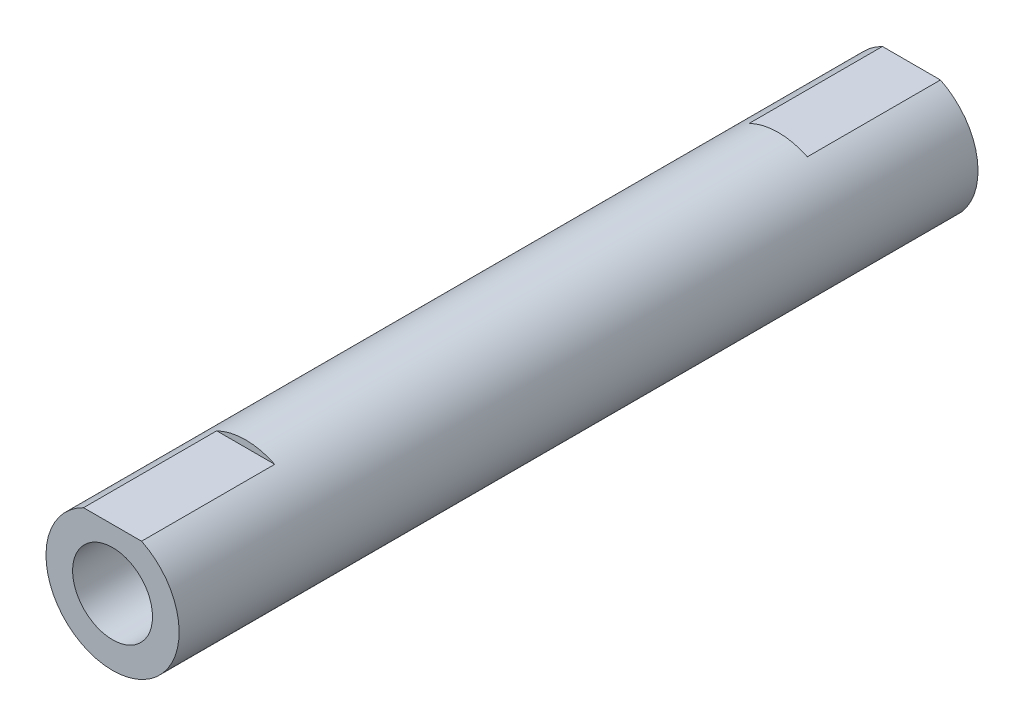
ISO-10303-21;
HEADER;
FILE_DESCRIPTION(('STEP AP214'),'2;1');
FILE_NAME('part.step','',(''),(''),'','','');
FILE_SCHEMA(('AUTOMOTIVE_DESIGN { 1 0 10303 214 1 1 1 1 }'));
ENDSEC;
DATA;
#1=APPLICATION_CONTEXT('core data for automotive mechanical design processes');
#2=APPLICATION_PROTOCOL_DEFINITION('international standard','automotive_design',2000,#1);
#3=PRODUCT_CONTEXT('',#1,'mechanical');
#4=PRODUCT('Part','Part','',(#3));
#5=PRODUCT_RELATED_PRODUCT_CATEGORY('part','',(#4));
#6=PRODUCT_DEFINITION_FORMATION('','',#4);
#7=PRODUCT_DEFINITION_CONTEXT('part definition',#1,'design');
#8=PRODUCT_DEFINITION('design','',#6,#7);
#9=PRODUCT_DEFINITION_SHAPE('','',#8);
#10=(LENGTH_UNIT() NAMED_UNIT(*) SI_UNIT(.MILLI.,.METRE.));
#11=(NAMED_UNIT(*) PLANE_ANGLE_UNIT() SI_UNIT($,.RADIAN.));
#12=(NAMED_UNIT(*) SI_UNIT($,.STERADIAN.) SOLID_ANGLE_UNIT());
#13=UNCERTAINTY_MEASURE_WITH_UNIT(LENGTH_MEASURE(1.E-05),#10,'distance_accuracy_value','');
#14=(GEOMETRIC_REPRESENTATION_CONTEXT(3) GLOBAL_UNCERTAINTY_ASSIGNED_CONTEXT((#13)) GLOBAL_UNIT_ASSIGNED_CONTEXT((#10,
#11,#12)) REPRESENTATION_CONTEXT('',''));
#15=CARTESIAN_POINT('',(0.,0.,0.));
#16=DIRECTION('',(0.,0.,1.));
#17=DIRECTION('',(1.,0.,0.));
#18=AXIS2_PLACEMENT_3D('',#15,#16,#17);
#19=CARTESIAN_POINT('',(0.,0.,-30.));
#20=DIRECTION('',(0.,0.,1.));
#21=DIRECTION('',(1.,0.,0.));
#22=AXIS2_PLACEMENT_3D('',#19,#20,#21);
#23=PLANE('',#22);
#24=CARTESIAN_POINT('',(0.,0.,-30.));
#25=DIRECTION('',(0.,0.,1.));
#26=DIRECTION('',(1.,0.,0.));
#27=AXIS2_PLACEMENT_3D('',#24,#25,#26);
#28=CIRCLE('',#27,3.);
#29=CARTESIAN_POINT('',(3.,0.,-30.));
#30=VERTEX_POINT('',#29);
#31=EDGE_CURVE('E95',#30,#30,#28,.T.);
#32=ORIENTED_EDGE('',*,*,#31,.T.);
#33=EDGE_LOOP('',(#32));
#34=FACE_BOUND('',#33,.T.);
#35=DIRECTION('',(1.,0.,0.));
#36=VECTOR('',#35,1.);
#37=CARTESIAN_POINT('',(0.,4.5,-30.));
#38=LINE('',#37,#36);
#39=CARTESIAN_POINT('',(-2.17944947177034,4.5,-30.));
#40=VERTEX_POINT('',#39);
#41=CARTESIAN_POINT('',(2.17944947177034,4.5,-30.));
#42=VERTEX_POINT('',#41);
#43=EDGE_CURVE('E43',#40,#42,#38,.T.);
#44=ORIENTED_EDGE('',*,*,#43,.T.);
#45=CARTESIAN_POINT('',(0.,0.,-30.));
#46=DIRECTION('',(0.,0.,1.));
#47=DIRECTION('',(1.,0.,0.));
#48=AXIS2_PLACEMENT_3D('',#45,#46,#47);
#49=CIRCLE('',#48,5.);
#50=EDGE_CURVE('E50',#40,#42,#49,.T.);
#51=ORIENTED_EDGE('',*,*,#50,.F.);
#52=EDGE_LOOP('',(#44,#51));
#53=FACE_BOUND('',#52,.T.);
#54=ADVANCED_FACE('F39',(#34,#53),#23,.F.);
#55=CARTESIAN_POINT('',(0.,0.,30.));
#56=DIRECTION('',(0.,0.,-1.));
#57=DIRECTION('',(-1.,0.,0.));
#58=AXIS2_PLACEMENT_3D('',#55,#56,#57);
#59=CYLINDRICAL_SURFACE('',#58,5.);
#60=CARTESIAN_POINT('',(0.,0.,30.));
#61=DIRECTION('',(0.,0.,1.));
#62=DIRECTION('',(1.,0.,0.));
#63=AXIS2_PLACEMENT_3D('',#60,#61,#62);
#64=CIRCLE('',#63,5.);
#65=CARTESIAN_POINT('',(-2.17944947177034,4.5,30.));
#66=VERTEX_POINT('',#65);
#67=CARTESIAN_POINT('',(2.17944947177034,4.5,30.));
#68=VERTEX_POINT('',#67);
#69=EDGE_CURVE('E11',#66,#68,#64,.T.);
#70=ORIENTED_EDGE('',*,*,#69,.F.);
#71=DIRECTION('',(0.,0.,1.));
#72=VECTOR('',#71,1.);
#73=CARTESIAN_POINT('',(-2.17944947177034,4.5,20.));
#74=LINE('',#73,#72);
#75=CARTESIAN_POINT('',(-2.17944947177034,4.5,20.));
#76=VERTEX_POINT('',#75);
#77=EDGE_CURVE('E84',#76,#66,#74,.T.);
#78=ORIENTED_EDGE('',*,*,#77,.F.);
#79=CARTESIAN_POINT('',(0.,0.,20.));
#80=DIRECTION('',(0.,0.,1.));
#81=DIRECTION('',(1.,0.,0.));
#82=AXIS2_PLACEMENT_3D('',#79,#80,#81);
#83=CIRCLE('',#82,5.);
#84=CARTESIAN_POINT('',(2.17944947177034,4.5,20.));
#85=VERTEX_POINT('',#84);
#86=EDGE_CURVE('E99',#85,#76,#83,.T.);
#87=ORIENTED_EDGE('',*,*,#86,.F.);
#88=DIRECTION('',(0.,0.,1.));
#89=VECTOR('',#88,1.);
#90=CARTESIAN_POINT('',(2.17944947177034,4.5,20.));
#91=LINE('',#90,#89);
#92=EDGE_CURVE('E90',#85,#68,#91,.T.);
#93=ORIENTED_EDGE('',*,*,#92,.T.);
#94=EDGE_LOOP('',(#70,#78,#87,#93));
#95=FACE_BOUND('',#94,.T.);
#96=DIRECTION('',(0.,0.,-1.));
#97=VECTOR('',#96,1.);
#98=CARTESIAN_POINT('',(2.17944947177034,4.5,-20.));
#99=LINE('',#98,#97);
#100=CARTESIAN_POINT('',(2.17944947177034,4.5,-20.));
#101=VERTEX_POINT('',#100);
#102=EDGE_CURVE('E75',#101,#42,#99,.T.);
#103=ORIENTED_EDGE('',*,*,#102,.F.);
#104=CARTESIAN_POINT('',(0.,0.,-20.));
#105=DIRECTION('',(0.,0.,1.));
#106=DIRECTION('',(1.,0.,0.));
#107=AXIS2_PLACEMENT_3D('',#104,#105,#106);
#108=CIRCLE('',#107,5.);
#109=CARTESIAN_POINT('',(-2.17944947177034,4.5,-20.));
#110=VERTEX_POINT('',#109);
#111=EDGE_CURVE('E132',#101,#110,#108,.T.);
#112=ORIENTED_EDGE('',*,*,#111,.T.);
#113=DIRECTION('',(0.,0.,-1.));
#114=VECTOR('',#113,1.);
#115=CARTESIAN_POINT('',(-2.17944947177034,4.5,-20.));
#116=LINE('',#115,#114);
#117=EDGE_CURVE('E59',#110,#40,#116,.T.);
#118=ORIENTED_EDGE('',*,*,#117,.T.);
#119=ORIENTED_EDGE('',*,*,#50,.T.);
#120=EDGE_LOOP('',(#103,#112,#118,#119));
#121=FACE_BOUND('',#120,.T.);
#122=ADVANCED_FACE('F41',(#95,#121),#59,.T.);
#123=CARTESIAN_POINT('',(0.,0.,30.));
#124=DIRECTION('',(0.,0.,1.));
#125=DIRECTION('',(1.,0.,0.));
#126=AXIS2_PLACEMENT_3D('',#123,#124,#125);
#127=PLANE('',#126);
#128=DIRECTION('',(1.,0.,0.));
#129=VECTOR('',#128,1.);
#130=CARTESIAN_POINT('',(-2.17944947177034,4.5,30.));
#131=LINE('',#130,#129);
#132=EDGE_CURVE('E87',#66,#68,#131,.T.);
#133=ORIENTED_EDGE('',*,*,#132,.F.);
#134=ORIENTED_EDGE('',*,*,#69,.T.);
#135=EDGE_LOOP('',(#133,#134));
#136=FACE_BOUND('',#135,.T.);
#137=CARTESIAN_POINT('',(0.,0.,30.));
#138=DIRECTION('',(0.,0.,1.));
#139=DIRECTION('',(1.,0.,0.));
#140=AXIS2_PLACEMENT_3D('',#137,#138,#139);
#141=CIRCLE('',#140,3.);
#142=CARTESIAN_POINT('',(3.,0.,30.));
#143=VERTEX_POINT('',#142);
#144=EDGE_CURVE('E109',#143,#143,#141,.T.);
#145=ORIENTED_EDGE('',*,*,#144,.F.);
#146=EDGE_LOOP('',(#145));
#147=FACE_BOUND('',#146,.T.);
#148=ADVANCED_FACE('F102',(#136,#147),#127,.T.);
#149=CARTESIAN_POINT('',(0.,0.,30.));
#150=DIRECTION('',(0.,0.,-1.));
#151=DIRECTION('',(-1.,0.,0.));
#152=AXIS2_PLACEMENT_3D('',#149,#150,#151);
#153=CYLINDRICAL_SURFACE('',#152,3.);
#154=ORIENTED_EDGE('',*,*,#144,.T.);
#155=EDGE_LOOP('',(#154));
#156=FACE_BOUND('',#155,.T.);
#157=ORIENTED_EDGE('',*,*,#31,.F.);
#158=EDGE_LOOP('',(#157));
#159=FACE_BOUND('',#158,.T.);
#160=ADVANCED_FACE('F105',(#156,#159),#153,.F.);
#161=CARTESIAN_POINT('',(-2.17944947177034,4.5,20.));
#162=DIRECTION('',(0.,-1.,0.));
#163=DIRECTION('',(0.,0.,-1.));
#164=AXIS2_PLACEMENT_3D('',#161,#162,#163);
#165=PLANE('',#164);
#166=ORIENTED_EDGE('',*,*,#132,.T.);
#167=ORIENTED_EDGE('',*,*,#92,.F.);
#168=DIRECTION('',(1.,0.,0.));
#169=VECTOR('',#168,1.);
#170=CARTESIAN_POINT('',(-2.17944947177034,4.5,20.));
#171=LINE('',#170,#169);
#172=EDGE_CURVE('E121',#76,#85,#171,.T.);
#173=ORIENTED_EDGE('',*,*,#172,.F.);
#174=ORIENTED_EDGE('',*,*,#77,.T.);
#175=EDGE_LOOP('',(#166,#167,#173,#174));
#176=FACE_BOUND('',#175,.T.);
#177=ADVANCED_FACE('F89',(#176),#165,.F.);
#178=CARTESIAN_POINT('',(0.,0.,20.));
#179=DIRECTION('',(0.,0.,1.));
#180=DIRECTION('',(1.,0.,0.));
#181=AXIS2_PLACEMENT_3D('',#178,#179,#180);
#182=PLANE('',#181);
#183=ORIENTED_EDGE('',*,*,#86,.T.);
#184=ORIENTED_EDGE('',*,*,#172,.T.);
#185=EDGE_LOOP('',(#183,#184));
#186=FACE_BOUND('',#185,.T.);
#187=ADVANCED_FACE('F144',(#186),#182,.T.);
#188=CARTESIAN_POINT('',(-2.17944947177034,4.5,-20.));
#189=DIRECTION('',(0.,1.,0.));
#190=DIRECTION('',(0.,0.,1.));
#191=AXIS2_PLACEMENT_3D('',#188,#189,#190);
#192=PLANE('',#191);
#193=ORIENTED_EDGE('',*,*,#43,.F.);
#194=ORIENTED_EDGE('',*,*,#117,.F.);
#195=DIRECTION('',(1.,0.,0.));
#196=VECTOR('',#195,1.);
#197=CARTESIAN_POINT('',(-2.17944947177034,4.5,-20.));
#198=LINE('',#197,#196);
#199=EDGE_CURVE('E77',#110,#101,#198,.T.);
#200=ORIENTED_EDGE('',*,*,#199,.T.);
#201=ORIENTED_EDGE('',*,*,#102,.T.);
#202=EDGE_LOOP('',(#193,#194,#200,#201));
#203=FACE_BOUND('',#202,.T.);
#204=ADVANCED_FACE('F139',(#203),#192,.T.);
#205=CARTESIAN_POINT('',(0.,0.,-20.));
#206=DIRECTION('',(0.,0.,-1.));
#207=DIRECTION('',(1.,0.,0.));
#208=AXIS2_PLACEMENT_3D('',#205,#206,#207);
#209=PLANE('',#208);
#210=ORIENTED_EDGE('',*,*,#111,.F.);
#211=ORIENTED_EDGE('',*,*,#199,.F.);
#212=EDGE_LOOP('',(#210,#211));
#213=FACE_BOUND('',#212,.T.);
#214=ADVANCED_FACE('F137',(#213),#209,.T.);
#215=CLOSED_SHELL('',(#54,#122,#148,#160,#177,#187,#204,#214));
#216=MANIFOLD_SOLID_BREP('B2',#215);
#217=ADVANCED_BREP_SHAPE_REPRESENTATION('',(#18,#216),#14);
#218=SHAPE_DEFINITION_REPRESENTATION(#9,#217);
ENDSEC;
END-ISO-10303-21;
